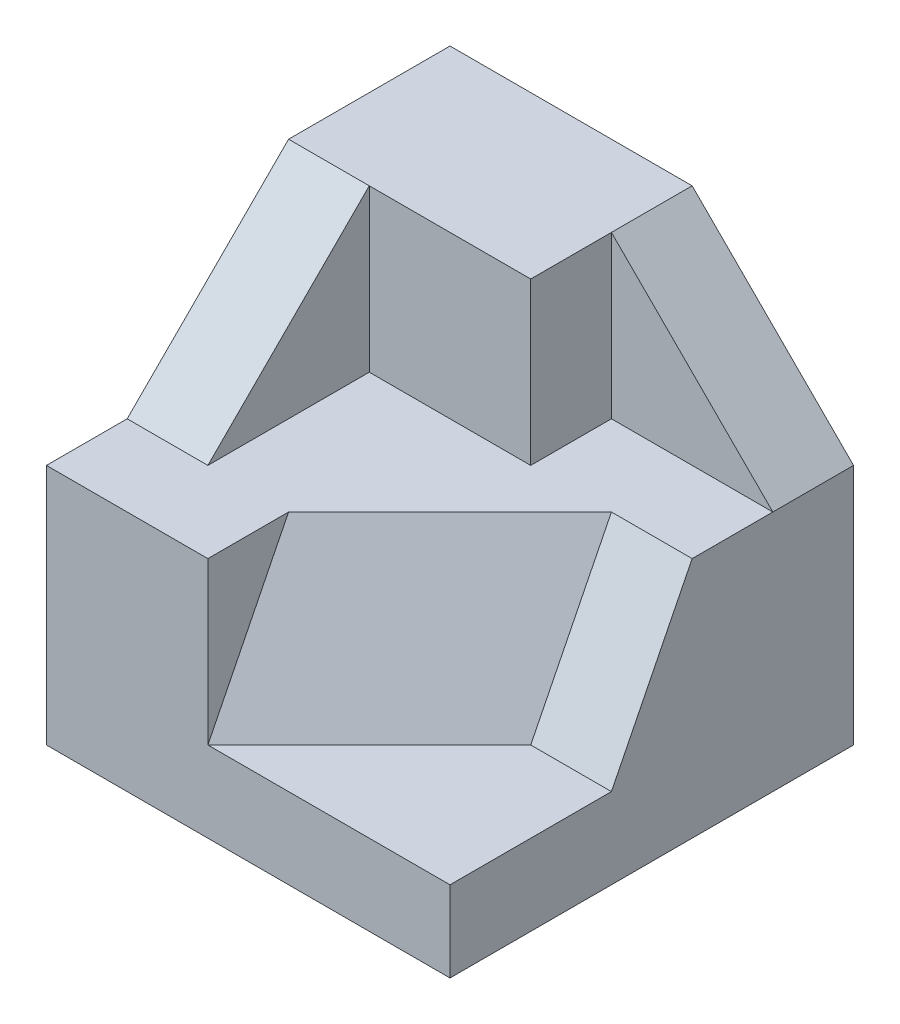
ISO-10303-21;
HEADER;
FILE_DESCRIPTION(('STEP AP214'),'2;1');
FILE_NAME('part.step','',(''),(''),'','','');
FILE_SCHEMA(('AUTOMOTIVE_DESIGN { 1 0 10303 214 1 1 1 1 }'));
ENDSEC;
DATA;
#1=APPLICATION_CONTEXT('core data for automotive mechanical design processes');
#2=APPLICATION_PROTOCOL_DEFINITION('international standard','automotive_design',2000,#1);
#3=PRODUCT_CONTEXT('',#1,'mechanical');
#4=PRODUCT('Part','Part','',(#3));
#5=PRODUCT_RELATED_PRODUCT_CATEGORY('part','',(#4));
#6=PRODUCT_DEFINITION_FORMATION('','',#4);
#7=PRODUCT_DEFINITION_CONTEXT('part definition',#1,'design');
#8=PRODUCT_DEFINITION('design','',#6,#7);
#9=PRODUCT_DEFINITION_SHAPE('','',#8);
#10=(LENGTH_UNIT() NAMED_UNIT(*) SI_UNIT(.MILLI.,.METRE.));
#11=(NAMED_UNIT(*) PLANE_ANGLE_UNIT() SI_UNIT($,.RADIAN.));
#12=(NAMED_UNIT(*) SI_UNIT($,.STERADIAN.) SOLID_ANGLE_UNIT());
#13=UNCERTAINTY_MEASURE_WITH_UNIT(LENGTH_MEASURE(1.E-05),#10,'distance_accuracy_value','');
#14=(GEOMETRIC_REPRESENTATION_CONTEXT(3) GLOBAL_UNCERTAINTY_ASSIGNED_CONTEXT((#13)) GLOBAL_UNIT_ASSIGNED_CONTEXT((#10,
#11,#12)) REPRESENTATION_CONTEXT('',''));
#15=CARTESIAN_POINT('',(0.,0.,0.));
#16=DIRECTION('',(0.,0.,1.));
#17=DIRECTION('',(1.,0.,0.));
#18=AXIS2_PLACEMENT_3D('',#15,#16,#17);
#19=CARTESIAN_POINT('',(2.5,2.5,5.));
#20=DIRECTION('',(0.,-1.,0.));
#21=DIRECTION('',(0.,0.,-1.));
#22=AXIS2_PLACEMENT_3D('',#19,#20,#21);
#23=PLANE('',#22);
#24=DIRECTION('',(0.,0.,1.));
#25=VECTOR('',#24,1.);
#26=CARTESIAN_POINT('',(0.5,2.5,1.));
#27=LINE('',#26,#25);
#28=CARTESIAN_POINT('',(0.5,2.5,1.));
#29=VERTEX_POINT('',#28);
#30=CARTESIAN_POINT('',(0.5,2.5,2.));
#31=VERTEX_POINT('',#30);
#32=EDGE_CURVE('E182',#29,#31,#27,.T.);
#33=ORIENTED_EDGE('',*,*,#32,.F.);
#34=DIRECTION('',(0.,0.,1.));
#35=VECTOR('',#34,1.);
#36=CARTESIAN_POINT('',(0.5,2.5,0.));
#37=LINE('',#36,#35);
#38=CARTESIAN_POINT('',(0.5,2.5,0.));
#39=VERTEX_POINT('',#38);
#40=EDGE_CURVE('E170',#39,#29,#37,.T.);
#41=ORIENTED_EDGE('',*,*,#40,.F.);
#42=DIRECTION('',(-1.,0.,0.));
#43=VECTOR('',#42,1.);
#44=CARTESIAN_POINT('',(2.5,2.5,0.));
#45=LINE('',#44,#43);
#46=CARTESIAN_POINT('',(-2.5,2.5,0.));
#47=VERTEX_POINT('',#46);
#48=EDGE_CURVE('E215',#39,#47,#45,.T.);
#49=ORIENTED_EDGE('',*,*,#48,.T.);
#50=DIRECTION('',(0.,0.,-1.));
#51=VECTOR('',#50,1.);
#52=CARTESIAN_POINT('',(-2.5,2.5,5.));
#53=LINE('',#52,#51);
#54=CARTESIAN_POINT('',(-2.5,2.5,2.));
#55=VERTEX_POINT('',#54);
#56=EDGE_CURVE('E220',#55,#47,#53,.T.);
#57=ORIENTED_EDGE('',*,*,#56,.F.);
#58=DIRECTION('',(-1.,0.,0.));
#59=VECTOR('',#58,1.);
#60=CARTESIAN_POINT('',(-1.5,2.5,2.));
#61=LINE('',#60,#59);
#62=CARTESIAN_POINT('',(-1.5,2.5,2.));
#63=VERTEX_POINT('',#62);
#64=EDGE_CURVE('E193',#63,#55,#61,.T.);
#65=ORIENTED_EDGE('',*,*,#64,.F.);
#66=DIRECTION('',(-1.,0.,0.));
#67=VECTOR('',#66,1.);
#68=CARTESIAN_POINT('',(-0.5,2.5,2.));
#69=LINE('',#68,#67);
#70=EDGE_CURVE('E196',#31,#63,#69,.T.);
#71=ORIENTED_EDGE('',*,*,#70,.F.);
#72=EDGE_LOOP('',(#33,#41,#49,#57,#65,#71));
#73=FACE_BOUND('',#72,.T.);
#74=ADVANCED_FACE('F33',(#73),#23,.F.);
#75=CARTESIAN_POINT('',(-2.5,-2.5,5.));
#76=DIRECTION('',(1.,0.,0.));
#77=DIRECTION('',(0.,0.,-1.));
#78=AXIS2_PLACEMENT_3D('',#75,#76,#77);
#79=PLANE('',#78);
#80=DIRECTION('',(0.,0.,1.));
#81=VECTOR('',#80,1.);
#82=CARTESIAN_POINT('',(-2.5,0.5,4.));
#83=LINE('',#82,#81);
#84=CARTESIAN_POINT('',(-2.5,0.5,4.));
#85=VERTEX_POINT('',#84);
#86=CARTESIAN_POINT('',(-2.5,0.5,5.));
#87=VERTEX_POINT('',#86);
#88=EDGE_CURVE('E56',#85,#87,#83,.T.);
#89=ORIENTED_EDGE('',*,*,#88,.F.);
#90=DIRECTION('',(0.,-0.707106781186548,0.707106781186548));
#91=VECTOR('',#90,1.);
#92=CARTESIAN_POINT('',(-2.5,0.5,4.));
#93=LINE('',#92,#91);
#94=EDGE_CURVE('E189',#55,#85,#93,.T.);
#95=ORIENTED_EDGE('',*,*,#94,.F.);
#96=ORIENTED_EDGE('',*,*,#56,.T.);
#97=DIRECTION('',(0.,-1.,0.));
#98=VECTOR('',#97,1.);
#99=CARTESIAN_POINT('',(-2.5,-2.5,0.));
#100=LINE('',#99,#98);
#101=CARTESIAN_POINT('',(-2.5,-2.5,0.));
#102=VERTEX_POINT('',#101);
#103=EDGE_CURVE('E211',#47,#102,#100,.T.);
#104=ORIENTED_EDGE('',*,*,#103,.T.);
#105=DIRECTION('',(0.,0.,-1.));
#106=VECTOR('',#105,1.);
#107=CARTESIAN_POINT('',(-2.5,-2.5,5.));
#108=LINE('',#107,#106);
#109=CARTESIAN_POINT('',(-2.5,-2.5,5.));
#110=VERTEX_POINT('',#109);
#111=EDGE_CURVE('E11',#110,#102,#108,.T.);
#112=ORIENTED_EDGE('',*,*,#111,.F.);
#113=DIRECTION('',(0.,-1.,0.));
#114=VECTOR('',#113,1.);
#115=CARTESIAN_POINT('',(-2.5,-2.5,5.));
#116=LINE('',#115,#114);
#117=EDGE_CURVE('E212',#87,#110,#116,.T.);
#118=ORIENTED_EDGE('',*,*,#117,.F.);
#119=EDGE_LOOP('',(#89,#95,#96,#104,#112,#118));
#120=FACE_BOUND('',#119,.T.);
#121=ADVANCED_FACE('F35',(#120),#79,.F.);
#122=CARTESIAN_POINT('',(2.5,-2.5,5.));
#123=DIRECTION('',(0.,1.,0.));
#124=DIRECTION('',(-1.,0.,0.));
#125=AXIS2_PLACEMENT_3D('',#122,#123,#124);
#126=PLANE('',#125);
#127=DIRECTION('',(1.,0.,0.));
#128=VECTOR('',#127,1.);
#129=CARTESIAN_POINT('',(2.5,-2.5,0.));
#130=LINE('',#129,#128);
#131=CARTESIAN_POINT('',(2.5,-2.5,0.));
#132=VERTEX_POINT('',#131);
#133=EDGE_CURVE('E223',#102,#132,#130,.T.);
#134=ORIENTED_EDGE('',*,*,#133,.T.);
#135=DIRECTION('',(0.,0.,-1.));
#136=VECTOR('',#135,1.);
#137=CARTESIAN_POINT('',(2.5,-2.5,5.));
#138=LINE('',#137,#136);
#139=CARTESIAN_POINT('',(2.5,-2.5,5.));
#140=VERTEX_POINT('',#139);
#141=EDGE_CURVE('E41',#140,#132,#138,.T.);
#142=ORIENTED_EDGE('',*,*,#141,.F.);
#143=DIRECTION('',(1.,0.,0.));
#144=VECTOR('',#143,1.);
#145=CARTESIAN_POINT('',(2.5,-2.5,5.));
#146=LINE('',#145,#144);
#147=EDGE_CURVE('E214',#110,#140,#146,.T.);
#148=ORIENTED_EDGE('',*,*,#147,.F.);
#149=ORIENTED_EDGE('',*,*,#111,.T.);
#150=EDGE_LOOP('',(#134,#142,#148,#149));
#151=FACE_BOUND('',#150,.T.);
#152=ADVANCED_FACE('F271',(#151),#126,.F.);
#153=CARTESIAN_POINT('',(2.5,-2.5,5.));
#154=DIRECTION('',(-1.,0.,0.));
#155=DIRECTION('',(0.,0.,1.));
#156=AXIS2_PLACEMENT_3D('',#153,#154,#155);
#157=PLANE('',#156);
#158=DIRECTION('',(0.,0.,1.));
#159=VECTOR('',#158,1.);
#160=CARTESIAN_POINT('',(2.5,0.5,2.));
#161=LINE('',#160,#159);
#162=CARTESIAN_POINT('',(2.5,0.5,1.));
#163=VERTEX_POINT('',#162);
#164=CARTESIAN_POINT('',(2.5,0.5,2.));
#165=VERTEX_POINT('',#164);
#166=EDGE_CURVE('E186',#163,#165,#161,.T.);
#167=ORIENTED_EDGE('',*,*,#166,.T.);
#168=DIRECTION('',(0.,0.894427190999916,-0.447213595499958));
#169=VECTOR('',#168,1.);
#170=CARTESIAN_POINT('',(2.5,-1.5,3.));
#171=LINE('',#170,#169);
#172=CARTESIAN_POINT('',(2.5,-1.5,3.));
#173=VERTEX_POINT('',#172);
#174=EDGE_CURVE('E140',#173,#165,#171,.T.);
#175=ORIENTED_EDGE('',*,*,#174,.F.);
#176=DIRECTION('',(0.,0.,-1.));
#177=VECTOR('',#176,1.);
#178=CARTESIAN_POINT('',(2.5,-1.5,5.));
#179=LINE('',#178,#177);
#180=CARTESIAN_POINT('',(2.5,-1.5,5.));
#181=VERTEX_POINT('',#180);
#182=EDGE_CURVE('E154',#181,#173,#179,.T.);
#183=ORIENTED_EDGE('',*,*,#182,.F.);
#184=DIRECTION('',(0.,1.,0.));
#185=VECTOR('',#184,1.);
#186=CARTESIAN_POINT('',(2.5,-2.5,5.));
#187=LINE('',#186,#185);
#188=EDGE_CURVE('E217',#140,#181,#187,.T.);
#189=ORIENTED_EDGE('',*,*,#188,.F.);
#190=ORIENTED_EDGE('',*,*,#141,.T.);
#191=DIRECTION('',(0.,1.,0.));
#192=VECTOR('',#191,1.);
#193=CARTESIAN_POINT('',(2.5,-2.5,0.));
#194=LINE('',#193,#192);
#195=CARTESIAN_POINT('',(2.5,0.5,0.));
#196=VERTEX_POINT('',#195);
#197=EDGE_CURVE('E225',#132,#196,#194,.T.);
#198=ORIENTED_EDGE('',*,*,#197,.T.);
#199=DIRECTION('',(0.,0.,1.));
#200=VECTOR('',#199,1.);
#201=CARTESIAN_POINT('',(2.5,0.5,0.));
#202=LINE('',#201,#200);
#203=EDGE_CURVE('E172',#196,#163,#202,.T.);
#204=ORIENTED_EDGE('',*,*,#203,.T.);
#205=EDGE_LOOP('',(#167,#175,#183,#189,#190,#198,#204));
#206=FACE_BOUND('',#205,.T.);
#207=ADVANCED_FACE('F235',(#206),#157,.F.);
#208=CARTESIAN_POINT('',(0.,0.,5.));
#209=DIRECTION('',(0.,0.,1.));
#210=DIRECTION('',(1.,0.,0.));
#211=AXIS2_PLACEMENT_3D('',#208,#209,#210);
#212=PLANE('',#211);
#213=DIRECTION('',(0.,1.,0.));
#214=VECTOR('',#213,1.);
#215=CARTESIAN_POINT('',(-0.5,-1.5,5.));
#216=LINE('',#215,#214);
#217=CARTESIAN_POINT('',(-0.500000000000001,-1.5,5.));
#218=VERTEX_POINT('',#217);
#219=CARTESIAN_POINT('',(-0.5,0.5,5.));
#220=VERTEX_POINT('',#219);
#221=EDGE_CURVE('E163',#218,#220,#216,.T.);
#222=ORIENTED_EDGE('',*,*,#221,.T.);
#223=DIRECTION('',(1.,0.,0.));
#224=VECTOR('',#223,1.);
#225=CARTESIAN_POINT('',(-2.5,0.5,5.));
#226=LINE('',#225,#224);
#227=EDGE_CURVE('E198',#87,#220,#226,.T.);
#228=ORIENTED_EDGE('',*,*,#227,.F.);
#229=ORIENTED_EDGE('',*,*,#117,.T.);
#230=ORIENTED_EDGE('',*,*,#147,.T.);
#231=ORIENTED_EDGE('',*,*,#188,.T.);
#232=DIRECTION('',(1.,0.,0.));
#233=VECTOR('',#232,1.);
#234=CARTESIAN_POINT('',(-0.5,-1.5,5.));
#235=LINE('',#234,#233);
#236=EDGE_CURVE('E152',#218,#181,#235,.T.);
#237=ORIENTED_EDGE('',*,*,#236,.F.);
#238=EDGE_LOOP('',(#222,#228,#229,#230,#231,#237));
#239=FACE_BOUND('',#238,.T.);
#240=ADVANCED_FACE('F267',(#239),#212,.T.);
#241=CARTESIAN_POINT('',(0.,0.,0.));
#242=DIRECTION('',(0.,0.,1.));
#243=DIRECTION('',(1.,0.,0.));
#244=AXIS2_PLACEMENT_3D('',#241,#242,#243);
#245=PLANE('',#244);
#246=ORIENTED_EDGE('',*,*,#48,.F.);
#247=DIRECTION('',(0.707106781186548,-0.707106781186548,0.));
#248=VECTOR('',#247,1.);
#249=CARTESIAN_POINT('',(2.5,0.5,0.));
#250=LINE('',#249,#248);
#251=EDGE_CURVE('E167',#39,#196,#250,.T.);
#252=ORIENTED_EDGE('',*,*,#251,.T.);
#253=ORIENTED_EDGE('',*,*,#197,.F.);
#254=ORIENTED_EDGE('',*,*,#133,.F.);
#255=ORIENTED_EDGE('',*,*,#103,.F.);
#256=EDGE_LOOP('',(#246,#252,#253,#254,#255));
#257=FACE_BOUND('',#256,.T.);
#258=ADVANCED_FACE('F241',(#257),#245,.F.);
#259=CARTESIAN_POINT('',(-1.5,0.5,2.));
#260=DIRECTION('',(-1.,0.,0.));
#261=DIRECTION('',(0.,0.,1.));
#262=AXIS2_PLACEMENT_3D('',#259,#260,#261);
#263=PLANE('',#262);
#264=DIRECTION('',(0.,1.,0.));
#265=VECTOR('',#264,1.);
#266=CARTESIAN_POINT('',(-1.5,0.5,2.));
#267=LINE('',#266,#265);
#268=CARTESIAN_POINT('',(-1.5,0.5,2.));
#269=VERTEX_POINT('',#268);
#270=EDGE_CURVE('E207',#269,#63,#267,.T.);
#271=ORIENTED_EDGE('',*,*,#270,.T.);
#272=DIRECTION('',(0.,-0.707106781186548,0.707106781186548));
#273=VECTOR('',#272,1.);
#274=CARTESIAN_POINT('',(-1.5,0.5,4.));
#275=LINE('',#274,#273);
#276=CARTESIAN_POINT('',(-1.5,0.5,4.));
#277=VERTEX_POINT('',#276);
#278=EDGE_CURVE('E190',#63,#277,#275,.T.);
#279=ORIENTED_EDGE('',*,*,#278,.T.);
#280=DIRECTION('',(0.,0.,1.));
#281=VECTOR('',#280,1.);
#282=CARTESIAN_POINT('',(-1.5,0.5,2.));
#283=LINE('',#282,#281);
#284=EDGE_CURVE('E202',#269,#277,#283,.T.);
#285=ORIENTED_EDGE('',*,*,#284,.F.);
#286=EDGE_LOOP('',(#271,#279,#285));
#287=FACE_BOUND('',#286,.T.);
#288=ADVANCED_FACE('F276',(#287),#263,.F.);
#289=CARTESIAN_POINT('',(-0.5,0.5,2.));
#290=DIRECTION('',(0.,0.,-1.));
#291=DIRECTION('',(-1.,0.,0.));
#292=AXIS2_PLACEMENT_3D('',#289,#290,#291);
#293=PLANE('',#292);
#294=DIRECTION('',(-1.,0.,0.));
#295=VECTOR('',#294,1.);
#296=CARTESIAN_POINT('',(-0.5,0.5,2.));
#297=LINE('',#296,#295);
#298=CARTESIAN_POINT('',(0.5,0.5,2.));
#299=VERTEX_POINT('',#298);
#300=EDGE_CURVE('E200',#299,#269,#297,.T.);
#301=ORIENTED_EDGE('',*,*,#300,.F.);
#302=DIRECTION('',(0.,-1.,0.));
#303=VECTOR('',#302,1.);
#304=CARTESIAN_POINT('',(0.5,0.5,2.));
#305=LINE('',#304,#303);
#306=EDGE_CURVE('E48',#31,#299,#305,.T.);
#307=ORIENTED_EDGE('',*,*,#306,.F.);
#308=ORIENTED_EDGE('',*,*,#70,.T.);
#309=ORIENTED_EDGE('',*,*,#270,.F.);
#310=EDGE_LOOP('',(#301,#307,#308,#309));
#311=FACE_BOUND('',#310,.T.);
#312=ADVANCED_FACE('F256',(#311),#293,.F.);
#313=CARTESIAN_POINT('',(0.,0.5,0.));
#314=DIRECTION('',(0.,1.,0.));
#315=DIRECTION('',(0.,0.,1.));
#316=AXIS2_PLACEMENT_3D('',#313,#314,#315);
#317=PLANE('',#316);
#318=DIRECTION('',(0.707106781186548,0.,-0.707106781186548));
#319=VECTOR('',#318,1.);
#320=CARTESIAN_POINT('',(-0.5,0.5,4.));
#321=LINE('',#320,#319);
#322=CARTESIAN_POINT('',(-0.5,0.5,4.));
#323=VERTEX_POINT('',#322);
#324=CARTESIAN_POINT('',(1.5,0.5,2.));
#325=VERTEX_POINT('',#324);
#326=EDGE_CURVE('E132',#323,#325,#321,.T.);
#327=ORIENTED_EDGE('',*,*,#326,.T.);
#328=DIRECTION('',(1.,0.,0.));
#329=VECTOR('',#328,1.);
#330=CARTESIAN_POINT('',(1.5,0.5,2.));
#331=LINE('',#330,#329);
#332=EDGE_CURVE('E139',#325,#165,#331,.T.);
#333=ORIENTED_EDGE('',*,*,#332,.T.);
#334=ORIENTED_EDGE('',*,*,#166,.F.);
#335=DIRECTION('',(1.,0.,0.));
#336=VECTOR('',#335,1.);
#337=CARTESIAN_POINT('',(2.5,0.5,1.));
#338=LINE('',#337,#336);
#339=CARTESIAN_POINT('',(0.5,0.5,1.));
#340=VERTEX_POINT('',#339);
#341=EDGE_CURVE('E179',#340,#163,#338,.T.);
#342=ORIENTED_EDGE('',*,*,#341,.F.);
#343=DIRECTION('',(0.,0.,1.));
#344=VECTOR('',#343,1.);
#345=CARTESIAN_POINT('',(0.5,0.5,1.));
#346=LINE('',#345,#344);
#347=EDGE_CURVE('E184',#340,#299,#346,.T.);
#348=ORIENTED_EDGE('',*,*,#347,.T.);
#349=ORIENTED_EDGE('',*,*,#300,.T.);
#350=ORIENTED_EDGE('',*,*,#284,.T.);
#351=DIRECTION('',(-1.,0.,0.));
#352=VECTOR('',#351,1.);
#353=CARTESIAN_POINT('',(-1.5,0.5,4.));
#354=LINE('',#353,#352);
#355=EDGE_CURVE('E205',#277,#85,#354,.T.);
#356=ORIENTED_EDGE('',*,*,#355,.T.);
#357=ORIENTED_EDGE('',*,*,#88,.T.);
#358=ORIENTED_EDGE('',*,*,#227,.T.);
#359=DIRECTION('',(0.,0.,1.));
#360=VECTOR('',#359,1.);
#361=CARTESIAN_POINT('',(-0.5,0.5,4.));
#362=LINE('',#361,#360);
#363=EDGE_CURVE('E147',#323,#220,#362,.T.);
#364=ORIENTED_EDGE('',*,*,#363,.F.);
#365=EDGE_LOOP('',(#327,#333,#334,#342,#348,#349,#350,#356,#357,#358,#364));
#366=FACE_BOUND('',#365,.T.);
#367=ADVANCED_FACE('F144',(#366),#317,.T.);
#368=CARTESIAN_POINT('',(-1.5,0.5,4.));
#369=DIRECTION('',(0.,-0.707106781186547,-0.707106781186547));
#370=DIRECTION('',(0.,0.707106781186548,-0.707106781186548));
#371=AXIS2_PLACEMENT_3D('',#368,#369,#370);
#372=PLANE('',#371);
#373=ORIENTED_EDGE('',*,*,#94,.T.);
#374=ORIENTED_EDGE('',*,*,#355,.F.);
#375=ORIENTED_EDGE('',*,*,#278,.F.);
#376=ORIENTED_EDGE('',*,*,#64,.T.);
#377=EDGE_LOOP('',(#373,#374,#375,#376));
#378=FACE_BOUND('',#377,.T.);
#379=ADVANCED_FACE('F277',(#378),#372,.F.);
#380=CARTESIAN_POINT('',(0.5,0.5,1.));
#381=DIRECTION('',(-1.,0.,0.));
#382=DIRECTION('',(0.,0.,1.));
#383=AXIS2_PLACEMENT_3D('',#380,#381,#382);
#384=PLANE('',#383);
#385=ORIENTED_EDGE('',*,*,#306,.T.);
#386=ORIENTED_EDGE('',*,*,#347,.F.);
#387=DIRECTION('',(0.,-1.,0.));
#388=VECTOR('',#387,1.);
#389=CARTESIAN_POINT('',(0.5,0.5,1.));
#390=LINE('',#389,#388);
#391=EDGE_CURVE('E176',#29,#340,#390,.T.);
#392=ORIENTED_EDGE('',*,*,#391,.F.);
#393=ORIENTED_EDGE('',*,*,#32,.T.);
#394=EDGE_LOOP('',(#385,#386,#392,#393));
#395=FACE_BOUND('',#394,.T.);
#396=ADVANCED_FACE('F253',(#395),#384,.F.);
#397=CARTESIAN_POINT('',(0.,0.,1.));
#398=DIRECTION('',(0.,0.,-1.));
#399=DIRECTION('',(-1.,0.,0.));
#400=AXIS2_PLACEMENT_3D('',#397,#398,#399);
#401=PLANE('',#400);
#402=ORIENTED_EDGE('',*,*,#341,.T.);
#403=DIRECTION('',(0.707106781186548,-0.707106781186548,0.));
#404=VECTOR('',#403,1.);
#405=CARTESIAN_POINT('',(2.5,0.5,1.));
#406=LINE('',#405,#404);
#407=EDGE_CURVE('E166',#29,#163,#406,.T.);
#408=ORIENTED_EDGE('',*,*,#407,.F.);
#409=ORIENTED_EDGE('',*,*,#391,.T.);
#410=EDGE_LOOP('',(#402,#408,#409));
#411=FACE_BOUND('',#410,.T.);
#412=ADVANCED_FACE('F262',(#411),#401,.F.);
#413=CARTESIAN_POINT('',(2.5,0.5,0.));
#414=DIRECTION('',(-0.707106781186547,-0.707106781186547,0.));
#415=DIRECTION('',(0.707106781186548,-0.707106781186548,0.));
#416=AXIS2_PLACEMENT_3D('',#413,#414,#415);
#417=PLANE('',#416);
#418=ORIENTED_EDGE('',*,*,#407,.T.);
#419=ORIENTED_EDGE('',*,*,#203,.F.);
#420=ORIENTED_EDGE('',*,*,#251,.F.);
#421=ORIENTED_EDGE('',*,*,#40,.T.);
#422=EDGE_LOOP('',(#418,#419,#420,#421));
#423=FACE_BOUND('',#422,.T.);
#424=ADVANCED_FACE('F245',(#423),#417,.F.);
#425=CARTESIAN_POINT('',(0.,-1.5,0.));
#426=DIRECTION('',(0.,1.,0.));
#427=DIRECTION('',(0.,0.,1.));
#428=AXIS2_PLACEMENT_3D('',#425,#426,#427);
#429=PLANE('',#428);
#430=ORIENTED_EDGE('',*,*,#236,.T.);
#431=ORIENTED_EDGE('',*,*,#182,.T.);
#432=DIRECTION('',(-1.,0.,0.));
#433=VECTOR('',#432,1.);
#434=CARTESIAN_POINT('',(2.5,-1.5,3.));
#435=LINE('',#434,#433);
#436=CARTESIAN_POINT('',(1.5,-1.5,3.));
#437=VERTEX_POINT('',#436);
#438=EDGE_CURVE('E160',#173,#437,#435,.T.);
#439=ORIENTED_EDGE('',*,*,#438,.T.);
#440=DIRECTION('',(-0.707106781186548,0.,0.707106781186548));
#441=VECTOR('',#440,1.);
#442=CARTESIAN_POINT('',(1.5,-1.5,3.));
#443=LINE('',#442,#441);
#444=EDGE_CURVE('E135',#437,#218,#443,.T.);
#445=ORIENTED_EDGE('',*,*,#444,.T.);
#446=EDGE_LOOP('',(#430,#431,#439,#445));
#447=FACE_BOUND('',#446,.T.);
#448=ADVANCED_FACE('F264',(#447),#429,.T.);
#449=CARTESIAN_POINT('',(1.5,-1.5,3.));
#450=DIRECTION('',(0.,-0.447213595499958,-0.894427190999916));
#451=DIRECTION('',(0.,0.894427190999916,-0.447213595499958));
#452=AXIS2_PLACEMENT_3D('',#449,#450,#451);
#453=PLANE('',#452);
#454=ORIENTED_EDGE('',*,*,#174,.T.);
#455=ORIENTED_EDGE('',*,*,#332,.F.);
#456=DIRECTION('',(0.,0.894427190999916,-0.447213595499958));
#457=VECTOR('',#456,1.);
#458=CARTESIAN_POINT('',(1.5,-1.5,3.));
#459=LINE('',#458,#457);
#460=EDGE_CURVE('E129',#437,#325,#459,.T.);
#461=ORIENTED_EDGE('',*,*,#460,.F.);
#462=ORIENTED_EDGE('',*,*,#438,.F.);
#463=EDGE_LOOP('',(#454,#455,#461,#462));
#464=FACE_BOUND('',#463,.T.);
#465=ADVANCED_FACE('F150',(#464),#453,.F.);
#466=CARTESIAN_POINT('',(-0.5,0.,0.));
#467=DIRECTION('',(-1.,0.,0.));
#468=DIRECTION('',(0.,0.,1.));
#469=AXIS2_PLACEMENT_3D('',#466,#467,#468);
#470=PLANE('',#469);
#471=ORIENTED_EDGE('',*,*,#221,.F.);
#472=DIRECTION('',(0.,0.894427190999916,-0.447213595499958));
#473=VECTOR('',#472,1.);
#474=CARTESIAN_POINT('',(-0.5,-1.5,5.));
#475=LINE('',#474,#473);
#476=EDGE_CURVE('E148',#218,#323,#475,.T.);
#477=ORIENTED_EDGE('',*,*,#476,.T.);
#478=ORIENTED_EDGE('',*,*,#363,.T.);
#479=EDGE_LOOP('',(#471,#477,#478));
#480=FACE_BOUND('',#479,.T.);
#481=ADVANCED_FACE('F353',(#480),#470,.F.);
#482=CARTESIAN_POINT('',(1.66666666666667,0.833333333333333,1.66666666666667));
#483=DIRECTION('',(-0.666666666666667,-0.333333333333333,-0.666666666666667));
#484=DIRECTION('',(-0.707106781186547,0.,0.707106781186547));
#485=AXIS2_PLACEMENT_3D('',#482,#483,#484);
#486=PLANE('',#485);
#487=ORIENTED_EDGE('',*,*,#476,.F.);
#488=ORIENTED_EDGE('',*,*,#444,.F.);
#489=ORIENTED_EDGE('',*,*,#460,.T.);
#490=ORIENTED_EDGE('',*,*,#326,.F.);
#491=EDGE_LOOP('',(#487,#488,#489,#490));
#492=FACE_BOUND('',#491,.T.);
#493=ADVANCED_FACE('F131',(#492),#486,.F.);
#494=CLOSED_SHELL('',(#74,#121,#152,#207,#240,#258,#288,#312,#367,#379,#396,#412,#424,#448,#465,
#481,#493));
#495=MANIFOLD_SOLID_BREP('B2',#494);
#496=ADVANCED_BREP_SHAPE_REPRESENTATION('',(#18,#495),#14);
#497=SHAPE_DEFINITION_REPRESENTATION(#9,#496);
ENDSEC;
END-ISO-10303-21;
